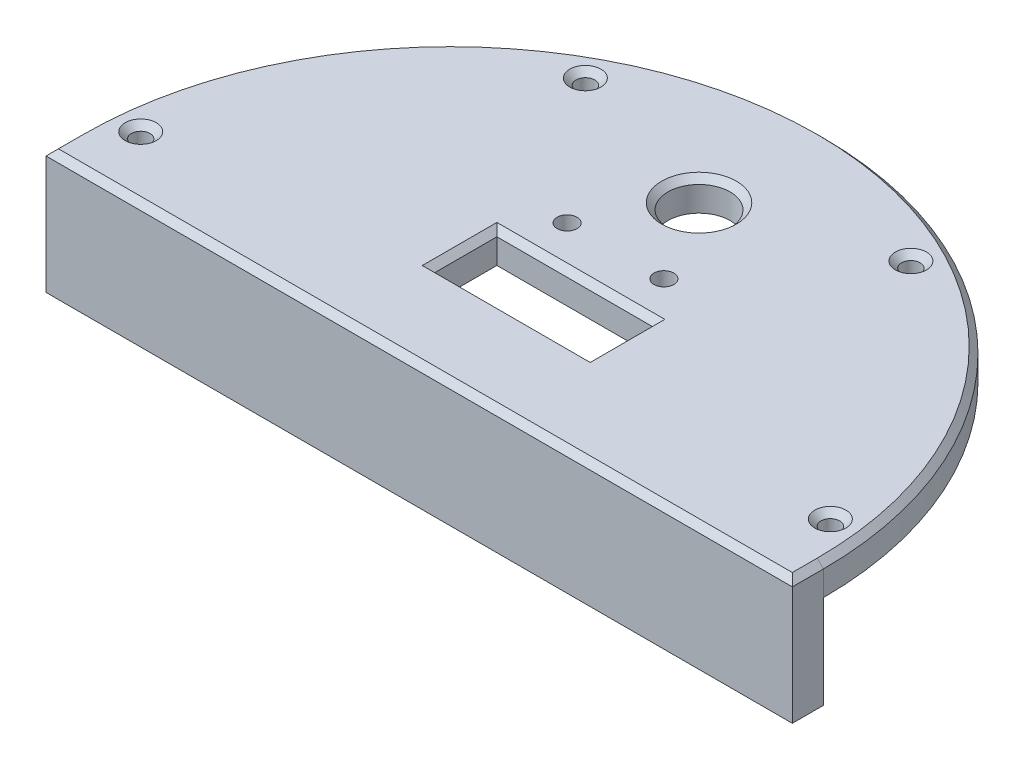
ISO-10303-21;
HEADER;
FILE_DESCRIPTION(('STEP AP214'),'2;1');
FILE_NAME('part.step','',(''),(''),'','','');
FILE_SCHEMA(('AUTOMOTIVE_DESIGN { 1 0 10303 214 1 1 1 1 }'));
ENDSEC;
DATA;
#1=APPLICATION_CONTEXT('core data for automotive mechanical design processes');
#2=APPLICATION_PROTOCOL_DEFINITION('international standard','automotive_design',2000,#1);
#3=PRODUCT_CONTEXT('',#1,'mechanical');
#4=PRODUCT('Part','Part','',(#3));
#5=PRODUCT_RELATED_PRODUCT_CATEGORY('part','',(#4));
#6=PRODUCT_DEFINITION_FORMATION('','',#4);
#7=PRODUCT_DEFINITION_CONTEXT('part definition',#1,'design');
#8=PRODUCT_DEFINITION('design','',#6,#7);
#9=PRODUCT_DEFINITION_SHAPE('','',#8);
#10=(LENGTH_UNIT() NAMED_UNIT(*) SI_UNIT(.MILLI.,.METRE.));
#11=(NAMED_UNIT(*) PLANE_ANGLE_UNIT() SI_UNIT($,.RADIAN.));
#12=(NAMED_UNIT(*) SI_UNIT($,.STERADIAN.) SOLID_ANGLE_UNIT());
#13=UNCERTAINTY_MEASURE_WITH_UNIT(LENGTH_MEASURE(1.E-05),#10,'distance_accuracy_value','');
#14=(GEOMETRIC_REPRESENTATION_CONTEXT(3) GLOBAL_UNCERTAINTY_ASSIGNED_CONTEXT((#13)) GLOBAL_UNIT_ASSIGNED_CONTEXT((#10,
#11,#12)) REPRESENTATION_CONTEXT('',''));
#15=CARTESIAN_POINT('',(0.,0.,0.));
#16=DIRECTION('',(0.,0.,1.));
#17=DIRECTION('',(1.,0.,0.));
#18=AXIS2_PLACEMENT_3D('',#15,#16,#17);
#19=CARTESIAN_POINT('',(0.,0.,0.));
#20=DIRECTION('',(0.,1.,0.));
#21=DIRECTION('',(0.,0.,1.));
#22=AXIS2_PLACEMENT_3D('',#19,#20,#21);
#23=PLANE('',#22);
#24=CARTESIAN_POINT('',(7.775,0.,-26.57206728095));
#25=DIRECTION('',(0.,1.,0.));
#26=DIRECTION('',(0.,0.,1.));
#27=AXIS2_PLACEMENT_3D('',#24,#25,#26);
#28=CIRCLE('',#27,3.5);
#29=CARTESIAN_POINT('',(7.775,0.,-23.07206728095));
#30=VERTEX_POINT('',#29);
#31=EDGE_CURVE('E11',#30,#30,#28,.T.);
#32=ORIENTED_EDGE('',*,*,#31,.T.);
#33=EDGE_LOOP('',(#32));
#34=FACE_BOUND('',#33,.T.);
#35=CARTESIAN_POINT('',(-7.785,0.,-26.57206728095));
#36=DIRECTION('',(0.,1.,0.));
#37=DIRECTION('',(0.,0.,1.));
#38=AXIS2_PLACEMENT_3D('',#35,#36,#37);
#39=CIRCLE('',#38,3.5);
#40=CARTESIAN_POINT('',(-7.785,0.,-23.07206728095));
#41=VERTEX_POINT('',#40);
#42=EDGE_CURVE('E50',#41,#41,#39,.T.);
#43=ORIENTED_EDGE('',*,*,#42,.T.);
#44=EDGE_LOOP('',(#43));
#45=FACE_BOUND('',#44,.T.);
#46=CARTESIAN_POINT('',(0.,0.,-40.));
#47=DIRECTION('',(0.,1.,0.));
#48=DIRECTION('',(0.,0.,1.));
#49=AXIS2_PLACEMENT_3D('',#46,#47,#48);
#50=CIRCLE('',#49,5.);
#51=CARTESIAN_POINT('',(0.,0.,-35.));
#52=VERTEX_POINT('',#51);
#53=EDGE_CURVE('E223',#52,#52,#50,.T.);
#54=ORIENTED_EDGE('',*,*,#53,.T.);
#55=EDGE_LOOP('',(#54));
#56=FACE_BOUND('',#55,.T.);
#57=DIRECTION('',(-1.,0.,0.));
#58=VECTOR('',#57,1.);
#59=CARTESIAN_POINT('',(0.,0.,-20.));
#60=LINE('',#59,#58);
#61=CARTESIAN_POINT('',(12.5,0.,-20.));
#62=VERTEX_POINT('',#61);
#63=CARTESIAN_POINT('',(-12.5,0.,-20.));
#64=VERTEX_POINT('',#63);
#65=EDGE_CURVE('E206',#62,#64,#60,.T.);
#66=ORIENTED_EDGE('',*,*,#65,.T.);
#67=DIRECTION('',(0.,0.,1.));
#68=VECTOR('',#67,1.);
#69=CARTESIAN_POINT('',(-12.5,0.,0.));
#70=LINE('',#69,#68);
#71=CARTESIAN_POINT('',(-12.5,0.,-10.));
#72=VERTEX_POINT('',#71);
#73=EDGE_CURVE('E218',#64,#72,#70,.T.);
#74=ORIENTED_EDGE('',*,*,#73,.T.);
#75=DIRECTION('',(1.,0.,0.));
#76=VECTOR('',#75,1.);
#77=CARTESIAN_POINT('',(0.,0.,-10.));
#78=LINE('',#77,#76);
#79=CARTESIAN_POINT('',(12.5,0.,-9.99999999999999));
#80=VERTEX_POINT('',#79);
#81=EDGE_CURVE('E214',#72,#80,#78,.T.);
#82=ORIENTED_EDGE('',*,*,#81,.T.);
#83=DIRECTION('',(0.,0.,-1.));
#84=VECTOR('',#83,1.);
#85=CARTESIAN_POINT('',(12.5,0.,0.));
#86=LINE('',#85,#84);
#87=EDGE_CURVE('E210',#80,#62,#86,.T.);
#88=ORIENTED_EDGE('',*,*,#87,.T.);
#89=EDGE_LOOP('',(#66,#74,#82,#88));
#90=FACE_BOUND('',#89,.T.);
#91=CARTESIAN_POINT('',(-26.4830688599984,0.,-48.204222468126));
#92=DIRECTION('',(0.,1.,0.));
#93=DIRECTION('',(-0.829037572555043,0.,0.559192903470745));
#94=AXIS2_PLACEMENT_3D('',#91,#92,#93);
#95=CIRCLE('',#94,1.5);
#96=CARTESIAN_POINT('',(-27.7266252188309,0.,-47.3654331129199));
#97=VERTEX_POINT('',#96);
#98=EDGE_CURVE('E177',#97,#97,#95,.T.);
#99=ORIENTED_EDGE('',*,*,#98,.T.);
#100=EDGE_LOOP('',(#99));
#101=FACE_BOUND('',#100,.T.);
#102=CARTESIAN_POINT('',(25.1539674132403,0.,-48.9109182430022));
#103=DIRECTION('',(0.,1.,0.));
#104=DIRECTION('',(-0.927183854566786,0.,-0.374606593415916));
#105=AXIS2_PLACEMENT_3D('',#102,#103,#104);
#106=CIRCLE('',#105,1.5);
#107=CARTESIAN_POINT('',(23.7631916313901,0.,-49.4728281331261));
#108=VERTEX_POINT('',#107);
#109=EDGE_CURVE('E182',#108,#108,#106,.T.);
#110=ORIENTED_EDGE('',*,*,#109,.T.);
#111=EDGE_LOOP('',(#110));
#112=FACE_BOUND('',#111,.T.);
#113=CARTESIAN_POINT('',(54.6149090032351,0.,-6.49705429932328));
#114=DIRECTION('',(0.,1.,0.));
#115=DIRECTION('',(-0.207911690817753,0.,-0.978147600733807));
#116=AXIS2_PLACEMENT_3D('',#113,#114,#115);
#117=CIRCLE('',#116,1.5);
#118=CARTESIAN_POINT('',(54.3030414670084,0.,-7.964275700424));
#119=VERTEX_POINT('',#118);
#120=EDGE_CURVE('E171',#119,#119,#117,.T.);
#121=ORIENTED_EDGE('',*,*,#120,.T.);
#122=EDGE_LOOP('',(#121));
#123=FACE_BOUND('',#122,.T.);
#124=CARTESIAN_POINT('',(-54.7722557505166,0.,-5.));
#125=DIRECTION('',(0.,1.,0.));
#126=DIRECTION('',(0.,0.,1.));
#127=AXIS2_PLACEMENT_3D('',#124,#125,#126);
#128=CIRCLE('',#127,1.5);
#129=CARTESIAN_POINT('',(-54.7722557505166,0.,-3.5));
#130=VERTEX_POINT('',#129);
#131=EDGE_CURVE('E181',#130,#130,#128,.T.);
#132=ORIENTED_EDGE('',*,*,#131,.T.);
#133=EDGE_LOOP('',(#132));
#134=FACE_BOUND('',#133,.T.);
#135=CARTESIAN_POINT('',(0.,0.,0.));
#136=DIRECTION('',(0.,1.,0.));
#137=DIRECTION('',(0.,0.,1.));
#138=AXIS2_PLACEMENT_3D('',#135,#136,#137);
#139=CIRCLE('',#138,60.);
#140=CARTESIAN_POINT('',(60.,0.,0.));
#141=VERTEX_POINT('',#140);
#142=CARTESIAN_POINT('',(-60.,0.,0.));
#143=VERTEX_POINT('',#142);
#144=EDGE_CURVE('E192',#141,#143,#139,.T.);
#145=ORIENTED_EDGE('',*,*,#144,.F.);
#146=DIRECTION('',(1.,0.,0.));
#147=VECTOR('',#146,1.);
#148=CARTESIAN_POINT('',(25.75,0.,0.));
#149=LINE('',#148,#147);
#150=EDGE_CURVE('E196',#143,#141,#149,.T.);
#151=ORIENTED_EDGE('',*,*,#150,.F.);
#152=EDGE_LOOP('',(#145,#151));
#153=FACE_BOUND('',#152,.T.);
#154=ADVANCED_FACE('F41',(#34,#45,#56,#90,#101,#112,#123,#134,#153),#23,.F.);
#155=CARTESIAN_POINT('',(0.,5.,0.));
#156=DIRECTION('',(0.,-1.,0.));
#157=DIRECTION('',(0.,0.,-1.));
#158=AXIS2_PLACEMENT_3D('',#155,#156,#157);
#159=CYLINDRICAL_SURFACE('',#158,60.);
#160=DIRECTION('',(0.,-1.,0.));
#161=VECTOR('',#160,1.);
#162=CARTESIAN_POINT('',(-60.,5.,0.));
#163=LINE('',#162,#161);
#164=CARTESIAN_POINT('',(-60.,3.99999999999997,0.));
#165=VERTEX_POINT('',#164);
#166=EDGE_CURVE('E203',#165,#143,#163,.T.);
#167=ORIENTED_EDGE('',*,*,#166,.F.);
#168=CARTESIAN_POINT('',(0.,3.99999999999997,0.));
#169=DIRECTION('',(0.,1.,0.));
#170=DIRECTION('',(0.,0.,1.));
#171=AXIS2_PLACEMENT_3D('',#168,#169,#170);
#172=CIRCLE('',#171,60.);
#173=CARTESIAN_POINT('',(60.,3.99999999999997,0.));
#174=VERTEX_POINT('',#173);
#175=EDGE_CURVE('E326',#165,#174,#172,.F.);
#176=ORIENTED_EDGE('',*,*,#175,.T.);
#177=DIRECTION('',(0.,-1.,0.));
#178=VECTOR('',#177,1.);
#179=CARTESIAN_POINT('',(60.,5.,0.));
#180=LINE('',#179,#178);
#181=EDGE_CURVE('E200',#174,#141,#180,.T.);
#182=ORIENTED_EDGE('',*,*,#181,.T.);
#183=ORIENTED_EDGE('',*,*,#144,.T.);
#184=EDGE_LOOP('',(#167,#176,#182,#183));
#185=FACE_BOUND('',#184,.T.);
#186=ADVANCED_FACE('F392',(#185),#159,.T.);
#187=CARTESIAN_POINT('',(0.,5.,0.));
#188=DIRECTION('',(0.,1.,0.));
#189=DIRECTION('',(0.,0.,1.));
#190=AXIS2_PLACEMENT_3D('',#187,#188,#189);
#191=PLANE('',#190);
#192=CARTESIAN_POINT('',(-7.785,5.,-26.57206728095));
#193=DIRECTION('',(0.,1.,0.));
#194=DIRECTION('',(0.,0.,1.));
#195=AXIS2_PLACEMENT_3D('',#192,#193,#194);
#196=CIRCLE('',#195,1.6);
#197=CARTESIAN_POINT('',(-7.785,5.,-24.97206728095));
#198=VERTEX_POINT('',#197);
#199=EDGE_CURVE('E335',#198,#198,#196,.T.);
#200=ORIENTED_EDGE('',*,*,#199,.F.);
#201=EDGE_LOOP('',(#200));
#202=FACE_BOUND('',#201,.T.);
#203=CARTESIAN_POINT('',(7.775,5.,-26.57206728095));
#204=DIRECTION('',(0.,1.,0.));
#205=DIRECTION('',(0.,0.,1.));
#206=AXIS2_PLACEMENT_3D('',#203,#204,#205);
#207=CIRCLE('',#206,1.6);
#208=CARTESIAN_POINT('',(7.775,5.,-24.97206728095));
#209=VERTEX_POINT('',#208);
#210=EDGE_CURVE('E358',#209,#209,#207,.T.);
#211=ORIENTED_EDGE('',*,*,#210,.F.);
#212=EDGE_LOOP('',(#211));
#213=FACE_BOUND('',#212,.T.);
#214=DIRECTION('',(0.,0.,-1.));
#215=VECTOR('',#214,1.);
#216=CARTESIAN_POINT('',(59.,5.,0.));
#217=LINE('',#216,#215);
#218=CARTESIAN_POINT('',(59.,5.,3.99999999999999));
#219=VERTEX_POINT('',#218);
#220=CARTESIAN_POINT('',(59.,5.,0.));
#221=VERTEX_POINT('',#220);
#222=EDGE_CURVE('E313',#219,#221,#217,.T.);
#223=ORIENTED_EDGE('',*,*,#222,.T.);
#224=CARTESIAN_POINT('',(0.,5.,0.));
#225=DIRECTION('',(0.,1.,0.));
#226=DIRECTION('',(0.,0.,1.));
#227=AXIS2_PLACEMENT_3D('',#224,#225,#226);
#228=CIRCLE('',#227,59.);
#229=CARTESIAN_POINT('',(-59.,5.,0.));
#230=VERTEX_POINT('',#229);
#231=EDGE_CURVE('E317',#221,#230,#228,.T.);
#232=ORIENTED_EDGE('',*,*,#231,.T.);
#233=DIRECTION('',(0.,0.,1.));
#234=VECTOR('',#233,1.);
#235=CARTESIAN_POINT('',(-59.,5.,5.));
#236=LINE('',#235,#234);
#237=CARTESIAN_POINT('',(-59.,5.,3.99999999999999));
#238=VERTEX_POINT('',#237);
#239=EDGE_CURVE('E310',#230,#238,#236,.T.);
#240=ORIENTED_EDGE('',*,*,#239,.T.);
#241=DIRECTION('',(1.,0.,0.));
#242=VECTOR('',#241,1.);
#243=CARTESIAN_POINT('',(0.,5.,3.99999999999999));
#244=LINE('',#243,#242);
#245=EDGE_CURVE('E293',#238,#219,#244,.T.);
#246=ORIENTED_EDGE('',*,*,#245,.T.);
#247=EDGE_LOOP('',(#223,#232,#240,#246));
#248=FACE_BOUND('',#247,.T.);
#249=CARTESIAN_POINT('',(54.6149090032351,5.,-6.49705429932328));
#250=DIRECTION('',(0.,1.,0.));
#251=DIRECTION('',(0.,0.,1.));
#252=AXIS2_PLACEMENT_3D('',#249,#250,#251);
#253=CIRCLE('',#252,2.50000000000004);
#254=CARTESIAN_POINT('',(54.6149090032351,5.,-3.99705429932324));
#255=VERTEX_POINT('',#254);
#256=EDGE_CURVE('E260',#255,#255,#253,.F.);
#257=ORIENTED_EDGE('',*,*,#256,.T.);
#258=EDGE_LOOP('',(#257));
#259=FACE_BOUND('',#258,.T.);
#260=DIRECTION('',(1.,0.,0.));
#261=VECTOR('',#260,1.);
#262=CARTESIAN_POINT('',(12.5,5.,-21.));
#263=LINE('',#262,#261);
#264=CARTESIAN_POINT('',(-13.5,5.,-21.));
#265=VERTEX_POINT('',#264);
#266=CARTESIAN_POINT('',(13.5,5.,-21.));
#267=VERTEX_POINT('',#266);
#268=EDGE_CURVE('E247',#265,#267,#263,.T.);
#269=ORIENTED_EDGE('',*,*,#268,.T.);
#270=DIRECTION('',(0.,0.,1.));
#271=VECTOR('',#270,1.);
#272=CARTESIAN_POINT('',(13.5,5.,-9.99999999999999));
#273=LINE('',#272,#271);
#274=CARTESIAN_POINT('',(13.5,5.,-9.));
#275=VERTEX_POINT('',#274);
#276=EDGE_CURVE('E256',#267,#275,#273,.T.);
#277=ORIENTED_EDGE('',*,*,#276,.T.);
#278=DIRECTION('',(-1.,0.,0.));
#279=VECTOR('',#278,1.);
#280=CARTESIAN_POINT('',(-12.5,5.,-9.));
#281=LINE('',#280,#279);
#282=CARTESIAN_POINT('',(-13.5,5.,-9.));
#283=VERTEX_POINT('',#282);
#284=EDGE_CURVE('E253',#275,#283,#281,.T.);
#285=ORIENTED_EDGE('',*,*,#284,.T.);
#286=DIRECTION('',(0.,0.,-1.));
#287=VECTOR('',#286,1.);
#288=CARTESIAN_POINT('',(-13.5,5.,-20.));
#289=LINE('',#288,#287);
#290=EDGE_CURVE('E250',#283,#265,#289,.T.);
#291=ORIENTED_EDGE('',*,*,#290,.T.);
#292=EDGE_LOOP('',(#269,#277,#285,#291));
#293=FACE_BOUND('',#292,.T.);
#294=CARTESIAN_POINT('',(25.1539674132403,5.,-48.9109182430022));
#295=DIRECTION('',(0.,1.,0.));
#296=DIRECTION('',(0.,0.,1.));
#297=AXIS2_PLACEMENT_3D('',#294,#295,#296);
#298=CIRCLE('',#297,2.50000000000004);
#299=CARTESIAN_POINT('',(25.1539674132403,5.,-46.4109182430022));
#300=VERTEX_POINT('',#299);
#301=EDGE_CURVE('E243',#300,#300,#298,.F.);
#302=ORIENTED_EDGE('',*,*,#301,.T.);
#303=EDGE_LOOP('',(#302));
#304=FACE_BOUND('',#303,.T.);
#305=CARTESIAN_POINT('',(-26.4830688599984,5.,-48.204222468126));
#306=DIRECTION('',(0.,1.,0.));
#307=DIRECTION('',(0.,0.,1.));
#308=AXIS2_PLACEMENT_3D('',#305,#306,#307);
#309=CIRCLE('',#308,2.50000000000004);
#310=CARTESIAN_POINT('',(-26.4830688599984,5.,-45.704222468126));
#311=VERTEX_POINT('',#310);
#312=EDGE_CURVE('E239',#311,#311,#309,.F.);
#313=ORIENTED_EDGE('',*,*,#312,.T.);
#314=EDGE_LOOP('',(#313));
#315=FACE_BOUND('',#314,.T.);
#316=CARTESIAN_POINT('',(0.,5.,-40.));
#317=DIRECTION('',(0.,1.,0.));
#318=DIRECTION('',(0.,0.,1.));
#319=AXIS2_PLACEMENT_3D('',#316,#317,#318);
#320=CIRCLE('',#319,5.99999999999999);
#321=CARTESIAN_POINT('',(0.,5.,-34.));
#322=VERTEX_POINT('',#321);
#323=EDGE_CURVE('E235',#322,#322,#320,.F.);
#324=ORIENTED_EDGE('',*,*,#323,.T.);
#325=EDGE_LOOP('',(#324));
#326=FACE_BOUND('',#325,.T.);
#327=CARTESIAN_POINT('',(-54.7722557505166,5.,-5.));
#328=DIRECTION('',(0.,1.,0.));
#329=DIRECTION('',(0.,0.,1.));
#330=AXIS2_PLACEMENT_3D('',#327,#328,#329);
#331=CIRCLE('',#330,2.50000000000002);
#332=CARTESIAN_POINT('',(-54.7722557505166,5.,-2.49999999999998));
#333=VERTEX_POINT('',#332);
#334=EDGE_CURVE('E231',#333,#333,#331,.F.);
#335=ORIENTED_EDGE('',*,*,#334,.T.);
#336=EDGE_LOOP('',(#335));
#337=FACE_BOUND('',#336,.T.);
#338=ADVANCED_FACE('F411',(#202,#213,#248,#259,#293,#304,#315,#326,#337),#191,.T.);
#339=CARTESIAN_POINT('',(-54.7722557505166,0.,-5.));
#340=DIRECTION('',(0.,1.,0.));
#341=DIRECTION('',(0.,0.,1.));
#342=AXIS2_PLACEMENT_3D('',#339,#340,#341);
#343=CYLINDRICAL_SURFACE('',#342,1.5);
#344=CARTESIAN_POINT('',(-54.7722557505166,4.,-5.));
#345=DIRECTION('',(0.,1.,0.));
#346=DIRECTION('',(0.,0.,1.));
#347=AXIS2_PLACEMENT_3D('',#344,#345,#346);
#348=CIRCLE('',#347,1.5);
#349=CARTESIAN_POINT('',(-54.7722557505166,4.,-3.5));
#350=VERTEX_POINT('',#349);
#351=EDGE_CURVE('E289',#350,#350,#348,.T.);
#352=ORIENTED_EDGE('',*,*,#351,.T.);
#353=EDGE_LOOP('',(#352));
#354=FACE_BOUND('',#353,.T.);
#355=ORIENTED_EDGE('',*,*,#131,.F.);
#356=EDGE_LOOP('',(#355));
#357=FACE_BOUND('',#356,.T.);
#358=ADVANCED_FACE('F414',(#354,#357),#343,.F.);
#359=CARTESIAN_POINT('',(54.6149090032351,0.,-6.49705429932328));
#360=DIRECTION('',(0.,1.,0.));
#361=DIRECTION('',(0.,0.,1.));
#362=AXIS2_PLACEMENT_3D('',#359,#360,#361);
#363=CYLINDRICAL_SURFACE('',#362,1.5);
#364=CARTESIAN_POINT('',(54.6149090032351,3.99999999999998,-6.49705429932328));
#365=DIRECTION('',(0.,1.,0.));
#366=DIRECTION('',(0.,0.,1.));
#367=AXIS2_PLACEMENT_3D('',#364,#365,#366);
#368=CIRCLE('',#367,1.5);
#369=CARTESIAN_POINT('',(54.6149090032351,3.99999999999998,-4.99705429932328));
#370=VERTEX_POINT('',#369);
#371=EDGE_CURVE('E222',#370,#370,#368,.T.);
#372=ORIENTED_EDGE('',*,*,#371,.T.);
#373=EDGE_LOOP('',(#372));
#374=FACE_BOUND('',#373,.T.);
#375=ORIENTED_EDGE('',*,*,#120,.F.);
#376=EDGE_LOOP('',(#375));
#377=FACE_BOUND('',#376,.T.);
#378=ADVANCED_FACE('F439',(#374,#377),#363,.F.);
#379=CARTESIAN_POINT('',(25.1539674132403,0.,-48.9109182430022));
#380=DIRECTION('',(0.,1.,0.));
#381=DIRECTION('',(0.,0.,1.));
#382=AXIS2_PLACEMENT_3D('',#379,#380,#381);
#383=CYLINDRICAL_SURFACE('',#382,1.5);
#384=CARTESIAN_POINT('',(25.1539674132403,3.99999999999997,-48.9109182430022));
#385=DIRECTION('',(0.,1.,0.));
#386=DIRECTION('',(0.,0.,1.));
#387=AXIS2_PLACEMENT_3D('',#384,#385,#386);
#388=CIRCLE('',#387,1.5);
#389=CARTESIAN_POINT('',(25.1539674132403,3.99999999999997,-47.4109182430022));
#390=VERTEX_POINT('',#389);
#391=EDGE_CURVE('E277',#390,#390,#388,.T.);
#392=ORIENTED_EDGE('',*,*,#391,.T.);
#393=EDGE_LOOP('',(#392));
#394=FACE_BOUND('',#393,.T.);
#395=ORIENTED_EDGE('',*,*,#109,.F.);
#396=EDGE_LOOP('',(#395));
#397=FACE_BOUND('',#396,.T.);
#398=ADVANCED_FACE('F594',(#394,#397),#383,.F.);
#399=CARTESIAN_POINT('',(-26.4830688599984,0.,-48.204222468126));
#400=DIRECTION('',(0.,1.,0.));
#401=DIRECTION('',(0.,0.,1.));
#402=AXIS2_PLACEMENT_3D('',#399,#400,#401);
#403=CYLINDRICAL_SURFACE('',#402,1.5);
#404=CARTESIAN_POINT('',(-26.4830688599984,3.99999999999997,-48.204222468126));
#405=DIRECTION('',(0.,1.,0.));
#406=DIRECTION('',(0.,0.,1.));
#407=AXIS2_PLACEMENT_3D('',#404,#405,#406);
#408=CIRCLE('',#407,1.5);
#409=CARTESIAN_POINT('',(-26.4830688599984,3.99999999999997,-46.704222468126));
#410=VERTEX_POINT('',#409);
#411=EDGE_CURVE('E281',#410,#410,#408,.T.);
#412=ORIENTED_EDGE('',*,*,#411,.T.);
#413=EDGE_LOOP('',(#412));
#414=FACE_BOUND('',#413,.T.);
#415=ORIENTED_EDGE('',*,*,#98,.F.);
#416=EDGE_LOOP('',(#415));
#417=FACE_BOUND('',#416,.T.);
#418=ADVANCED_FACE('F590',(#414,#417),#403,.F.);
#419=CARTESIAN_POINT('',(-12.5,5.,-10.));
#420=DIRECTION('',(-1.,0.,0.));
#421=DIRECTION('',(0.,0.,1.));
#422=AXIS2_PLACEMENT_3D('',#419,#420,#421);
#423=PLANE('',#422);
#424=DIRECTION('',(0.,-1.,0.));
#425=VECTOR('',#424,1.);
#426=CARTESIAN_POINT('',(-12.5,5.,-20.));
#427=LINE('',#426,#425);
#428=CARTESIAN_POINT('',(-12.5,4.,-20.));
#429=VERTEX_POINT('',#428);
#430=EDGE_CURVE('E159',#429,#64,#427,.T.);
#431=ORIENTED_EDGE('',*,*,#430,.F.);
#432=DIRECTION('',(0.,0.,1.));
#433=VECTOR('',#432,1.);
#434=CARTESIAN_POINT('',(-12.5,4.,-10.));
#435=LINE('',#434,#433);
#436=CARTESIAN_POINT('',(-12.5,4.,-10.));
#437=VERTEX_POINT('',#436);
#438=EDGE_CURVE('E271',#429,#437,#435,.T.);
#439=ORIENTED_EDGE('',*,*,#438,.T.);
#440=DIRECTION('',(0.,-1.,0.));
#441=VECTOR('',#440,1.);
#442=CARTESIAN_POINT('',(-12.5,5.,-10.));
#443=LINE('',#442,#441);
#444=EDGE_CURVE('E168',#437,#72,#443,.T.);
#445=ORIENTED_EDGE('',*,*,#444,.T.);
#446=ORIENTED_EDGE('',*,*,#73,.F.);
#447=EDGE_LOOP('',(#431,#439,#445,#446));
#448=FACE_BOUND('',#447,.T.);
#449=ADVANCED_FACE('F580',(#448),#423,.F.);
#450=CARTESIAN_POINT('',(-12.5,5.,-10.));
#451=DIRECTION('',(0.,0.,1.));
#452=DIRECTION('',(1.,0.,0.));
#453=AXIS2_PLACEMENT_3D('',#450,#451,#452);
#454=PLANE('',#453);
#455=ORIENTED_EDGE('',*,*,#444,.F.);
#456=DIRECTION('',(1.,0.,0.));
#457=VECTOR('',#456,1.);
#458=CARTESIAN_POINT('',(12.5,4.,-9.99999999999999));
#459=LINE('',#458,#457);
#460=CARTESIAN_POINT('',(12.5,4.,-9.99999999999999));
#461=VERTEX_POINT('',#460);
#462=EDGE_CURVE('E268',#437,#461,#459,.T.);
#463=ORIENTED_EDGE('',*,*,#462,.T.);
#464=DIRECTION('',(0.,-1.,0.));
#465=VECTOR('',#464,1.);
#466=CARTESIAN_POINT('',(12.5,5.,-9.99999999999999));
#467=LINE('',#466,#465);
#468=EDGE_CURVE('E172',#461,#80,#467,.T.);
#469=ORIENTED_EDGE('',*,*,#468,.T.);
#470=ORIENTED_EDGE('',*,*,#81,.F.);
#471=EDGE_LOOP('',(#455,#463,#469,#470));
#472=FACE_BOUND('',#471,.T.);
#473=ADVANCED_FACE('F576',(#472),#454,.F.);
#474=CARTESIAN_POINT('',(12.5,5.,-9.99999999999999));
#475=DIRECTION('',(1.,0.,0.));
#476=DIRECTION('',(0.,0.,-1.));
#477=AXIS2_PLACEMENT_3D('',#474,#475,#476);
#478=PLANE('',#477);
#479=ORIENTED_EDGE('',*,*,#468,.F.);
#480=DIRECTION('',(0.,0.,-1.));
#481=VECTOR('',#480,1.);
#482=CARTESIAN_POINT('',(12.5,4.,-20.));
#483=LINE('',#482,#481);
#484=CARTESIAN_POINT('',(12.5,4.,-20.));
#485=VERTEX_POINT('',#484);
#486=EDGE_CURVE('E264',#461,#485,#483,.T.);
#487=ORIENTED_EDGE('',*,*,#486,.T.);
#488=DIRECTION('',(0.,-1.,0.));
#489=VECTOR('',#488,1.);
#490=CARTESIAN_POINT('',(12.5,5.,-20.));
#491=LINE('',#490,#489);
#492=EDGE_CURVE('E163',#485,#62,#491,.T.);
#493=ORIENTED_EDGE('',*,*,#492,.T.);
#494=ORIENTED_EDGE('',*,*,#87,.F.);
#495=EDGE_LOOP('',(#479,#487,#493,#494));
#496=FACE_BOUND('',#495,.T.);
#497=ADVANCED_FACE('F579',(#496),#478,.F.);
#498=CARTESIAN_POINT('',(-12.5,5.,-20.));
#499=DIRECTION('',(0.,0.,-1.));
#500=DIRECTION('',(-1.,0.,0.));
#501=AXIS2_PLACEMENT_3D('',#498,#499,#500);
#502=PLANE('',#501);
#503=ORIENTED_EDGE('',*,*,#492,.F.);
#504=DIRECTION('',(-1.,0.,0.));
#505=VECTOR('',#504,1.);
#506=CARTESIAN_POINT('',(-12.5,4.,-20.));
#507=LINE('',#506,#505);
#508=EDGE_CURVE('E274',#485,#429,#507,.T.);
#509=ORIENTED_EDGE('',*,*,#508,.T.);
#510=ORIENTED_EDGE('',*,*,#430,.T.);
#511=ORIENTED_EDGE('',*,*,#65,.F.);
#512=EDGE_LOOP('',(#503,#509,#510,#511));
#513=FACE_BOUND('',#512,.T.);
#514=ADVANCED_FACE('F569',(#513),#502,.F.);
#515=CARTESIAN_POINT('',(0.,0.,0.));
#516=DIRECTION('',(0.,0.,1.));
#517=DIRECTION('',(1.,0.,0.));
#518=AXIS2_PLACEMENT_3D('',#515,#516,#517);
#519=PLANE('',#518);
#520=DIRECTION('',(0.,-1.,0.));
#521=VECTOR('',#520,1.);
#522=CARTESIAN_POINT('',(-60.,5.,0.));
#523=LINE('',#522,#521);
#524=CARTESIAN_POINT('',(-60.,-15.,0.));
#525=VERTEX_POINT('',#524);
#526=EDGE_CURVE('E156',#143,#525,#523,.T.);
#527=ORIENTED_EDGE('',*,*,#526,.F.);
#528=ORIENTED_EDGE('',*,*,#150,.T.);
#529=DIRECTION('',(0.,1.,0.));
#530=VECTOR('',#529,1.);
#531=CARTESIAN_POINT('',(60.,5.,0.));
#532=LINE('',#531,#530);
#533=CARTESIAN_POINT('',(60.,-15.,0.));
#534=VERTEX_POINT('',#533);
#535=EDGE_CURVE('E142',#534,#141,#532,.T.);
#536=ORIENTED_EDGE('',*,*,#535,.F.);
#537=DIRECTION('',(1.,0.,0.));
#538=VECTOR('',#537,1.);
#539=CARTESIAN_POINT('',(-60.,-15.,0.));
#540=LINE('',#539,#538);
#541=EDGE_CURVE('E377',#525,#534,#540,.T.);
#542=ORIENTED_EDGE('',*,*,#541,.F.);
#543=EDGE_LOOP('',(#527,#528,#536,#542));
#544=FACE_BOUND('',#543,.T.);
#545=ADVANCED_FACE('F387',(#544),#519,.F.);
#546=CARTESIAN_POINT('',(-60.,5.,5.));
#547=DIRECTION('',(1.,0.,0.));
#548=DIRECTION('',(0.,0.,-1.));
#549=AXIS2_PLACEMENT_3D('',#546,#547,#548);
#550=PLANE('',#549);
#551=DIRECTION('',(0.,-1.,0.));
#552=VECTOR('',#551,1.);
#553=CARTESIAN_POINT('',(-60.,5.,5.));
#554=LINE('',#553,#552);
#555=CARTESIAN_POINT('',(-60.,3.99999999999999,5.));
#556=VERTEX_POINT('',#555);
#557=CARTESIAN_POINT('',(-60.,-15.,5.));
#558=VERTEX_POINT('',#557);
#559=EDGE_CURVE('E135',#556,#558,#554,.T.);
#560=ORIENTED_EDGE('',*,*,#559,.F.);
#561=DIRECTION('',(0.,0.,-1.));
#562=VECTOR('',#561,1.);
#563=CARTESIAN_POINT('',(-60.,3.99999999999997,0.));
#564=LINE('',#563,#562);
#565=EDGE_CURVE('E64',#556,#165,#564,.T.);
#566=ORIENTED_EDGE('',*,*,#565,.T.);
#567=ORIENTED_EDGE('',*,*,#166,.T.);
#568=ORIENTED_EDGE('',*,*,#526,.T.);
#569=DIRECTION('',(0.,0.,-1.));
#570=VECTOR('',#569,1.);
#571=CARTESIAN_POINT('',(-60.,-15.,5.));
#572=LINE('',#571,#570);
#573=EDGE_CURVE('E147',#558,#525,#572,.T.);
#574=ORIENTED_EDGE('',*,*,#573,.F.);
#575=EDGE_LOOP('',(#560,#566,#567,#568,#574));
#576=FACE_BOUND('',#575,.T.);
#577=ADVANCED_FACE('F154',(#576),#550,.F.);
#578=CARTESIAN_POINT('',(-60.,-15.,5.));
#579=DIRECTION('',(0.,1.,0.));
#580=DIRECTION('',(0.,0.,1.));
#581=AXIS2_PLACEMENT_3D('',#578,#579,#580);
#582=PLANE('',#581);
#583=ORIENTED_EDGE('',*,*,#541,.T.);
#584=DIRECTION('',(0.,0.,-1.));
#585=VECTOR('',#584,1.);
#586=CARTESIAN_POINT('',(60.,-15.,5.));
#587=LINE('',#586,#585);
#588=CARTESIAN_POINT('',(60.,-15.,5.));
#589=VERTEX_POINT('',#588);
#590=EDGE_CURVE('E149',#589,#534,#587,.T.);
#591=ORIENTED_EDGE('',*,*,#590,.F.);
#592=DIRECTION('',(1.,0.,0.));
#593=VECTOR('',#592,1.);
#594=CARTESIAN_POINT('',(-60.,-15.,5.));
#595=LINE('',#594,#593);
#596=EDGE_CURVE('E138',#558,#589,#595,.T.);
#597=ORIENTED_EDGE('',*,*,#596,.F.);
#598=ORIENTED_EDGE('',*,*,#573,.T.);
#599=EDGE_LOOP('',(#583,#591,#597,#598));
#600=FACE_BOUND('',#599,.T.);
#601=ADVANCED_FACE('F146',(#600),#582,.F.);
#602=CARTESIAN_POINT('',(60.,5.,5.));
#603=DIRECTION('',(-1.,0.,0.));
#604=DIRECTION('',(0.,0.,1.));
#605=AXIS2_PLACEMENT_3D('',#602,#603,#604);
#606=PLANE('',#605);
#607=ORIENTED_EDGE('',*,*,#181,.F.);
#608=DIRECTION('',(0.,0.,1.));
#609=VECTOR('',#608,1.);
#610=CARTESIAN_POINT('',(60.,3.99999999999997,5.));
#611=LINE('',#610,#609);
#612=CARTESIAN_POINT('',(60.,3.99999999999999,5.));
#613=VERTEX_POINT('',#612);
#614=EDGE_CURVE('E320',#174,#613,#611,.T.);
#615=ORIENTED_EDGE('',*,*,#614,.T.);
#616=DIRECTION('',(0.,1.,0.));
#617=VECTOR('',#616,1.);
#618=CARTESIAN_POINT('',(60.,5.,5.));
#619=LINE('',#618,#617);
#620=EDGE_CURVE('E152',#589,#613,#619,.T.);
#621=ORIENTED_EDGE('',*,*,#620,.F.);
#622=ORIENTED_EDGE('',*,*,#590,.T.);
#623=ORIENTED_EDGE('',*,*,#535,.T.);
#624=EDGE_LOOP('',(#607,#615,#621,#622,#623));
#625=FACE_BOUND('',#624,.T.);
#626=ADVANCED_FACE('F384',(#625),#606,.F.);
#627=CARTESIAN_POINT('',(0.,0.,5.));
#628=DIRECTION('',(0.,0.,1.));
#629=DIRECTION('',(1.,0.,0.));
#630=AXIS2_PLACEMENT_3D('',#627,#628,#629);
#631=PLANE('',#630);
#632=ORIENTED_EDGE('',*,*,#620,.T.);
#633=DIRECTION('',(-1.,0.,0.));
#634=VECTOR('',#633,1.);
#635=CARTESIAN_POINT('',(0.,3.99999999999999,5.));
#636=LINE('',#635,#634);
#637=EDGE_CURVE('E57',#613,#556,#636,.T.);
#638=ORIENTED_EDGE('',*,*,#637,.T.);
#639=ORIENTED_EDGE('',*,*,#559,.T.);
#640=ORIENTED_EDGE('',*,*,#596,.T.);
#641=EDGE_LOOP('',(#632,#638,#639,#640));
#642=FACE_BOUND('',#641,.T.);
#643=ADVANCED_FACE('F137',(#642),#631,.T.);
#644=CARTESIAN_POINT('',(0.,-5.,-40.));
#645=DIRECTION('',(0.,1.,0.));
#646=DIRECTION('',(0.,0.,1.));
#647=AXIS2_PLACEMENT_3D('',#644,#645,#646);
#648=CYLINDRICAL_SURFACE('',#647,5.);
#649=CARTESIAN_POINT('',(0.,4.00000000000002,-40.));
#650=DIRECTION('',(0.,1.,0.));
#651=DIRECTION('',(0.,0.,1.));
#652=AXIS2_PLACEMENT_3D('',#649,#650,#651);
#653=CIRCLE('',#652,5.);
#654=CARTESIAN_POINT('',(0.,4.00000000000002,-35.));
#655=VERTEX_POINT('',#654);
#656=EDGE_CURVE('E285',#655,#655,#653,.T.);
#657=ORIENTED_EDGE('',*,*,#656,.T.);
#658=EDGE_LOOP('',(#657));
#659=FACE_BOUND('',#658,.T.);
#660=ORIENTED_EDGE('',*,*,#53,.F.);
#661=EDGE_LOOP('',(#660));
#662=FACE_BOUND('',#661,.T.);
#663=ADVANCED_FACE('F459',(#659,#662),#648,.F.);
#664=CARTESIAN_POINT('',(54.6149090032351,3.99999999999998,-6.49705429932328));
#665=DIRECTION('',(0.,1.,0.));
#666=DIRECTION('',(0.,0.,1.));
#667=AXIS2_PLACEMENT_3D('',#664,#665,#666);
#668=CONICAL_SURFACE('',#667,1.5,0.785398163397455);
#669=ORIENTED_EDGE('',*,*,#256,.F.);
#670=EDGE_LOOP('',(#669));
#671=FACE_BOUND('',#670,.T.);
#672=ORIENTED_EDGE('',*,*,#371,.F.);
#673=EDGE_LOOP('',(#672));
#674=FACE_BOUND('',#673,.T.);
#675=ADVANCED_FACE('F452',(#671,#674),#668,.F.);
#676=CARTESIAN_POINT('',(-13.5,5.,0.));
#677=DIRECTION('',(0.707106781186547,0.707106781186547,0.));
#678=DIRECTION('',(0.,0.,1.));
#679=AXIS2_PLACEMENT_3D('',#676,#677,#678);
#680=PLANE('',#679);
#681=DIRECTION('',(0.577350269189626,-0.577350269189626,-0.577350269189625));
#682=VECTOR('',#681,1.);
#683=CARTESIAN_POINT('',(-9.,0.499999999999997,-13.5));
#684=LINE('',#683,#682);
#685=EDGE_CURVE('E301',#437,#283,#684,.F.);
#686=ORIENTED_EDGE('',*,*,#685,.F.);
#687=ORIENTED_EDGE('',*,*,#438,.F.);
#688=DIRECTION('',(0.577350269189626,-0.577350269189626,0.577350269189625));
#689=VECTOR('',#688,1.);
#690=CARTESIAN_POINT('',(-6.50000000000001,-2.,-14.));
#691=LINE('',#690,#689);
#692=EDGE_CURVE('E227',#265,#429,#691,.T.);
#693=ORIENTED_EDGE('',*,*,#692,.F.);
#694=ORIENTED_EDGE('',*,*,#290,.F.);
#695=EDGE_LOOP('',(#686,#687,#693,#694));
#696=FACE_BOUND('',#695,.T.);
#697=ADVANCED_FACE('F458',(#696),#680,.T.);
#698=CARTESIAN_POINT('',(0.,5.,-21.));
#699=DIRECTION('',(0.,0.707106781186547,0.707106781186548));
#700=DIRECTION('',(-1.,0.,0.));
#701=AXIS2_PLACEMENT_3D('',#698,#699,#700);
#702=PLANE('',#701);
#703=ORIENTED_EDGE('',*,*,#692,.T.);
#704=ORIENTED_EDGE('',*,*,#508,.F.);
#705=DIRECTION('',(0.577350269189626,0.577350269189626,-0.577350269189625));
#706=VECTOR('',#705,1.);
#707=CARTESIAN_POINT('',(6.50000000000001,-1.99999999999999,-14.));
#708=LINE('',#707,#706);
#709=EDGE_CURVE('E297',#267,#485,#708,.F.);
#710=ORIENTED_EDGE('',*,*,#709,.F.);
#711=ORIENTED_EDGE('',*,*,#268,.F.);
#712=EDGE_LOOP('',(#703,#704,#710,#711));
#713=FACE_BOUND('',#712,.T.);
#714=ADVANCED_FACE('F477',(#713),#702,.T.);
#715=CARTESIAN_POINT('',(0.,5.,-9.));
#716=DIRECTION('',(0.,0.707106781186547,-0.707106781186548));
#717=DIRECTION('',(1.,0.,0.));
#718=AXIS2_PLACEMENT_3D('',#715,#716,#717);
#719=PLANE('',#718);
#720=ORIENTED_EDGE('',*,*,#685,.T.);
#721=ORIENTED_EDGE('',*,*,#284,.F.);
#722=DIRECTION('',(-0.577350269189626,-0.577350269189626,-0.577350269189625));
#723=VECTOR('',#722,1.);
#724=CARTESIAN_POINT('',(16.5,8.,-6.));
#725=LINE('',#724,#723);
#726=EDGE_CURVE('E294',#461,#275,#725,.F.);
#727=ORIENTED_EDGE('',*,*,#726,.F.);
#728=ORIENTED_EDGE('',*,*,#462,.F.);
#729=EDGE_LOOP('',(#720,#721,#727,#728));
#730=FACE_BOUND('',#729,.T.);
#731=ADVANCED_FACE('F470',(#730),#719,.T.);
#732=CARTESIAN_POINT('',(13.5,5.,0.));
#733=DIRECTION('',(-0.707106781186547,0.707106781186547,0.));
#734=DIRECTION('',(0.,0.,-1.));
#735=AXIS2_PLACEMENT_3D('',#732,#733,#734);
#736=PLANE('',#735);
#737=ORIENTED_EDGE('',*,*,#709,.T.);
#738=ORIENTED_EDGE('',*,*,#486,.F.);
#739=ORIENTED_EDGE('',*,*,#726,.T.);
#740=ORIENTED_EDGE('',*,*,#276,.F.);
#741=EDGE_LOOP('',(#737,#738,#739,#740));
#742=FACE_BOUND('',#741,.T.);
#743=ADVANCED_FACE('F462',(#742),#736,.T.);
#744=CARTESIAN_POINT('',(25.1539674132403,3.99999999999997,-48.9109182430022));
#745=DIRECTION('',(0.,1.,0.));
#746=DIRECTION('',(0.,0.,1.));
#747=AXIS2_PLACEMENT_3D('',#744,#745,#746);
#748=CONICAL_SURFACE('',#747,1.5,0.785398163397454);
#749=ORIENTED_EDGE('',*,*,#301,.F.);
#750=EDGE_LOOP('',(#749));
#751=FACE_BOUND('',#750,.T.);
#752=ORIENTED_EDGE('',*,*,#391,.F.);
#753=EDGE_LOOP('',(#752));
#754=FACE_BOUND('',#753,.T.);
#755=ADVANCED_FACE('F469',(#751,#754),#748,.F.);
#756=CARTESIAN_POINT('',(-26.4830688599984,3.99999999999997,-48.204222468126));
#757=DIRECTION('',(0.,1.,0.));
#758=DIRECTION('',(0.,0.,1.));
#759=AXIS2_PLACEMENT_3D('',#756,#757,#758);
#760=CONICAL_SURFACE('',#759,1.5,0.78539816339745);
#761=ORIENTED_EDGE('',*,*,#312,.F.);
#762=EDGE_LOOP('',(#761));
#763=FACE_BOUND('',#762,.T.);
#764=ORIENTED_EDGE('',*,*,#411,.F.);
#765=EDGE_LOOP('',(#764));
#766=FACE_BOUND('',#765,.T.);
#767=ADVANCED_FACE('F494',(#763,#766),#760,.F.);
#768=CARTESIAN_POINT('',(0.,4.00000000000002,-40.));
#769=DIRECTION('',(0.,1.,0.));
#770=DIRECTION('',(0.,0.,1.));
#771=AXIS2_PLACEMENT_3D('',#768,#769,#770);
#772=CONICAL_SURFACE('',#771,5.,0.785398163397453);
#773=ORIENTED_EDGE('',*,*,#323,.F.);
#774=EDGE_LOOP('',(#773));
#775=FACE_BOUND('',#774,.T.);
#776=ORIENTED_EDGE('',*,*,#656,.F.);
#777=EDGE_LOOP('',(#776));
#778=FACE_BOUND('',#777,.T.);
#779=ADVANCED_FACE('F433',(#775,#778),#772,.F.);
#780=CARTESIAN_POINT('',(-54.7722557505166,4.,-5.));
#781=DIRECTION('',(0.,1.,0.));
#782=DIRECTION('',(0.,0.,1.));
#783=AXIS2_PLACEMENT_3D('',#780,#781,#782);
#784=CONICAL_SURFACE('',#783,1.5,0.785398163397453);
#785=ORIENTED_EDGE('',*,*,#334,.F.);
#786=EDGE_LOOP('',(#785));
#787=FACE_BOUND('',#786,.T.);
#788=ORIENTED_EDGE('',*,*,#351,.F.);
#789=EDGE_LOOP('',(#788));
#790=FACE_BOUND('',#789,.T.);
#791=ADVANCED_FACE('F430',(#787,#790),#784,.F.);
#792=CARTESIAN_POINT('',(-60.,3.99999999999997,5.));
#793=DIRECTION('',(-0.707106781186552,0.707106781186543,0.));
#794=DIRECTION('',(0.,0.,1.));
#795=AXIS2_PLACEMENT_3D('',#792,#793,#794);
#796=PLANE('',#795);
#797=DIRECTION('',(0.707106781186543,0.707106781186552,0.));
#798=VECTOR('',#797,1.);
#799=CARTESIAN_POINT('',(-60.,3.99999999999997,0.));
#800=LINE('',#799,#798);
#801=EDGE_CURVE('E338',#165,#230,#800,.T.);
#802=ORIENTED_EDGE('',*,*,#801,.F.);
#803=ORIENTED_EDGE('',*,*,#565,.F.);
#804=DIRECTION('',(0.57735026918962,0.577350269189628,-0.577350269189628));
#805=VECTOR('',#804,1.);
#806=CARTESIAN_POINT('',(-40.0000000000004,23.9999999999999,-14.9999999999999));
#807=LINE('',#806,#805);
#808=EDGE_CURVE('E298',#238,#556,#807,.F.);
#809=ORIENTED_EDGE('',*,*,#808,.F.);
#810=ORIENTED_EDGE('',*,*,#239,.F.);
#811=EDGE_LOOP('',(#802,#803,#809,#810));
#812=FACE_BOUND('',#811,.T.);
#813=ADVANCED_FACE('F409',(#812),#796,.T.);
#814=CARTESIAN_POINT('',(0.,3.99999999999999,5.));
#815=DIRECTION('',(0.,-0.707106781186547,-0.707106781186547));
#816=DIRECTION('',(-1.,0.,0.));
#817=AXIS2_PLACEMENT_3D('',#814,#815,#816);
#818=PLANE('',#817);
#819=ORIENTED_EDGE('',*,*,#808,.T.);
#820=ORIENTED_EDGE('',*,*,#637,.F.);
#821=DIRECTION('',(0.57735026918962,-0.577350269189628,0.577350269189628));
#822=VECTOR('',#821,1.);
#823=CARTESIAN_POINT('',(40.0000000000004,23.9999999999999,-14.9999999999999));
#824=LINE('',#823,#822);
#825=EDGE_CURVE('E334',#219,#613,#824,.T.);
#826=ORIENTED_EDGE('',*,*,#825,.F.);
#827=ORIENTED_EDGE('',*,*,#245,.F.);
#828=EDGE_LOOP('',(#819,#820,#826,#827));
#829=FACE_BOUND('',#828,.T.);
#830=ADVANCED_FACE('F405',(#829),#818,.F.);
#831=CARTESIAN_POINT('',(0.,5.,0.));
#832=DIRECTION('',(0.,-1.,0.));
#833=DIRECTION('',(0.,0.,-1.));
#834=AXIS2_PLACEMENT_3D('',#831,#832,#833);
#835=CONICAL_SURFACE('',#834,59.,0.785398163397441);
#836=ORIENTED_EDGE('',*,*,#801,.T.);
#837=ORIENTED_EDGE('',*,*,#231,.F.);
#838=DIRECTION('',(-0.707106781186543,0.707106781186552,0.));
#839=VECTOR('',#838,1.);
#840=CARTESIAN_POINT('',(60.,3.99999999999997,0.));
#841=LINE('',#840,#839);
#842=EDGE_CURVE('E331',#174,#221,#841,.T.);
#843=ORIENTED_EDGE('',*,*,#842,.F.);
#844=ORIENTED_EDGE('',*,*,#175,.F.);
#845=EDGE_LOOP('',(#836,#837,#843,#844));
#846=FACE_BOUND('',#845,.T.);
#847=ADVANCED_FACE('F397',(#846),#835,.T.);
#848=CARTESIAN_POINT('',(59.,5.,0.));
#849=DIRECTION('',(0.707106781186552,0.707106781186543,0.));
#850=DIRECTION('',(0.,0.,1.));
#851=AXIS2_PLACEMENT_3D('',#848,#849,#850);
#852=PLANE('',#851);
#853=ORIENTED_EDGE('',*,*,#825,.T.);
#854=ORIENTED_EDGE('',*,*,#614,.F.);
#855=ORIENTED_EDGE('',*,*,#842,.T.);
#856=ORIENTED_EDGE('',*,*,#222,.F.);
#857=EDGE_LOOP('',(#853,#854,#855,#856));
#858=FACE_BOUND('',#857,.T.);
#859=ADVANCED_FACE('F401',(#858),#852,.T.);
#860=CARTESIAN_POINT('',(7.775,10.,-26.57206728095));
#861=DIRECTION('',(0.,-1.,0.));
#862=DIRECTION('',(0.,0.,-1.));
#863=AXIS2_PLACEMENT_3D('',#860,#861,#862);
#864=CYLINDRICAL_SURFACE('',#863,1.6);
#865=ORIENTED_EDGE('',*,*,#210,.T.);
#866=EDGE_LOOP('',(#865));
#867=FACE_BOUND('',#866,.T.);
#868=CARTESIAN_POINT('',(7.775,-1.,-26.57206728095));
#869=DIRECTION('',(0.,-1.,0.));
#870=DIRECTION('',(0.,0.,-1.));
#871=AXIS2_PLACEMENT_3D('',#868,#869,#870);
#872=CIRCLE('',#871,1.6);
#873=CARTESIAN_POINT('',(7.775,-1.,-28.17206728095));
#874=VERTEX_POINT('',#873);
#875=EDGE_CURVE('E544',#874,#874,#872,.T.);
#876=ORIENTED_EDGE('',*,*,#875,.T.);
#877=EDGE_LOOP('',(#876));
#878=FACE_BOUND('',#877,.T.);
#879=ADVANCED_FACE('F517',(#867,#878),#864,.F.);
#880=CARTESIAN_POINT('',(-7.785,10.,-26.57206728095));
#881=DIRECTION('',(0.,-1.,0.));
#882=DIRECTION('',(0.,0.,-1.));
#883=AXIS2_PLACEMENT_3D('',#880,#881,#882);
#884=CYLINDRICAL_SURFACE('',#883,1.6);
#885=ORIENTED_EDGE('',*,*,#199,.T.);
#886=EDGE_LOOP('',(#885));
#887=FACE_BOUND('',#886,.T.);
#888=CARTESIAN_POINT('',(-7.785,-1.,-26.57206728095));
#889=DIRECTION('',(0.,-1.,0.));
#890=DIRECTION('',(0.,0.,-1.));
#891=AXIS2_PLACEMENT_3D('',#888,#889,#890);
#892=CIRCLE('',#891,1.6);
#893=CARTESIAN_POINT('',(-7.785,-1.,-28.17206728095));
#894=VERTEX_POINT('',#893);
#895=EDGE_CURVE('E359',#894,#894,#892,.T.);
#896=ORIENTED_EDGE('',*,*,#895,.T.);
#897=EDGE_LOOP('',(#896));
#898=FACE_BOUND('',#897,.T.);
#899=ADVANCED_FACE('F552',(#887,#898),#884,.F.);
#900=CARTESIAN_POINT('',(-7.785,-1.,-26.57206728095));
#901=DIRECTION('',(0.,-1.,0.));
#902=DIRECTION('',(0.,0.,-1.));
#903=AXIS2_PLACEMENT_3D('',#900,#901,#902);
#904=PLANE('',#903);
#905=CARTESIAN_POINT('',(-7.785,-1.,-26.57206728095));
#906=DIRECTION('',(0.,-1.,0.));
#907=DIRECTION('',(0.,0.,-1.));
#908=AXIS2_PLACEMENT_3D('',#905,#906,#907);
#909=CIRCLE('',#908,2.5);
#910=CARTESIAN_POINT('',(-7.785,-1.,-29.07206728095));
#911=VERTEX_POINT('',#910);
#912=EDGE_CURVE('E355',#911,#911,#909,.T.);
#913=ORIENTED_EDGE('',*,*,#912,.T.);
#914=EDGE_LOOP('',(#913));
#915=FACE_BOUND('',#914,.T.);
#916=ORIENTED_EDGE('',*,*,#895,.F.);
#917=EDGE_LOOP('',(#916));
#918=FACE_BOUND('',#917,.T.);
#919=ADVANCED_FACE('F536',(#915,#918),#904,.T.);
#920=CARTESIAN_POINT('',(7.775,-1.,-26.57206728095));
#921=DIRECTION('',(0.,-1.,0.));
#922=DIRECTION('',(0.,0.,-1.));
#923=AXIS2_PLACEMENT_3D('',#920,#921,#922);
#924=PLANE('',#923);
#925=CARTESIAN_POINT('',(7.775,-1.,-26.57206728095));
#926=DIRECTION('',(0.,-1.,0.));
#927=DIRECTION('',(0.,0.,-1.));
#928=AXIS2_PLACEMENT_3D('',#925,#926,#927);
#929=CIRCLE('',#928,2.5);
#930=CARTESIAN_POINT('',(7.775,-1.,-29.07206728095));
#931=VERTEX_POINT('',#930);
#932=EDGE_CURVE('E366',#931,#931,#929,.T.);
#933=ORIENTED_EDGE('',*,*,#932,.T.);
#934=EDGE_LOOP('',(#933));
#935=FACE_BOUND('',#934,.T.);
#936=ORIENTED_EDGE('',*,*,#875,.F.);
#937=EDGE_LOOP('',(#936));
#938=FACE_BOUND('',#937,.T.);
#939=ADVANCED_FACE('F531',(#935,#938),#924,.T.);
#940=CARTESIAN_POINT('',(7.775,-1.,-26.57206728095));
#941=DIRECTION('',(0.,1.,0.));
#942=DIRECTION('',(0.,0.,1.));
#943=AXIS2_PLACEMENT_3D('',#940,#941,#942);
#944=TOROIDAL_SURFACE('',#943,3.5,1.);
#945=ORIENTED_EDGE('',*,*,#31,.F.);
#946=EDGE_LOOP('',(#945));
#947=FACE_BOUND('',#946,.T.);
#948=ORIENTED_EDGE('',*,*,#932,.F.);
#949=EDGE_LOOP('',(#948));
#950=FACE_BOUND('',#949,.T.);
#951=ADVANCED_FACE('F352',(#947,#950),#944,.F.);
#952=CARTESIAN_POINT('',(-7.785,-1.,-26.57206728095));
#953=DIRECTION('',(0.,1.,0.));
#954=DIRECTION('',(0.,0.,1.));
#955=AXIS2_PLACEMENT_3D('',#952,#953,#954);
#956=TOROIDAL_SURFACE('',#955,3.5,1.);
#957=ORIENTED_EDGE('',*,*,#42,.F.);
#958=EDGE_LOOP('',(#957));
#959=FACE_BOUND('',#958,.T.);
#960=ORIENTED_EDGE('',*,*,#912,.F.);
#961=EDGE_LOOP('',(#960));
#962=FACE_BOUND('',#961,.T.);
#963=ADVANCED_FACE('F43',(#959,#962),#956,.F.);
#964=CLOSED_SHELL('',(#154,#186,#338,#358,#378,#398,#418,#449,#473,#497,#514,#545,#577,#601,
#626,#643,#663,#675,#697,#714,#731,#743,#755,#767,#779,#791,#813,#830,#847,#859,#879,#899,#919,
#939,#951,#963));
#965=MANIFOLD_SOLID_BREP('B2',#964);
#966=ADVANCED_BREP_SHAPE_REPRESENTATION('',(#18,#965),#14);
#967=SHAPE_DEFINITION_REPRESENTATION(#9,#966);
ENDSEC;
END-ISO-10303-21;
